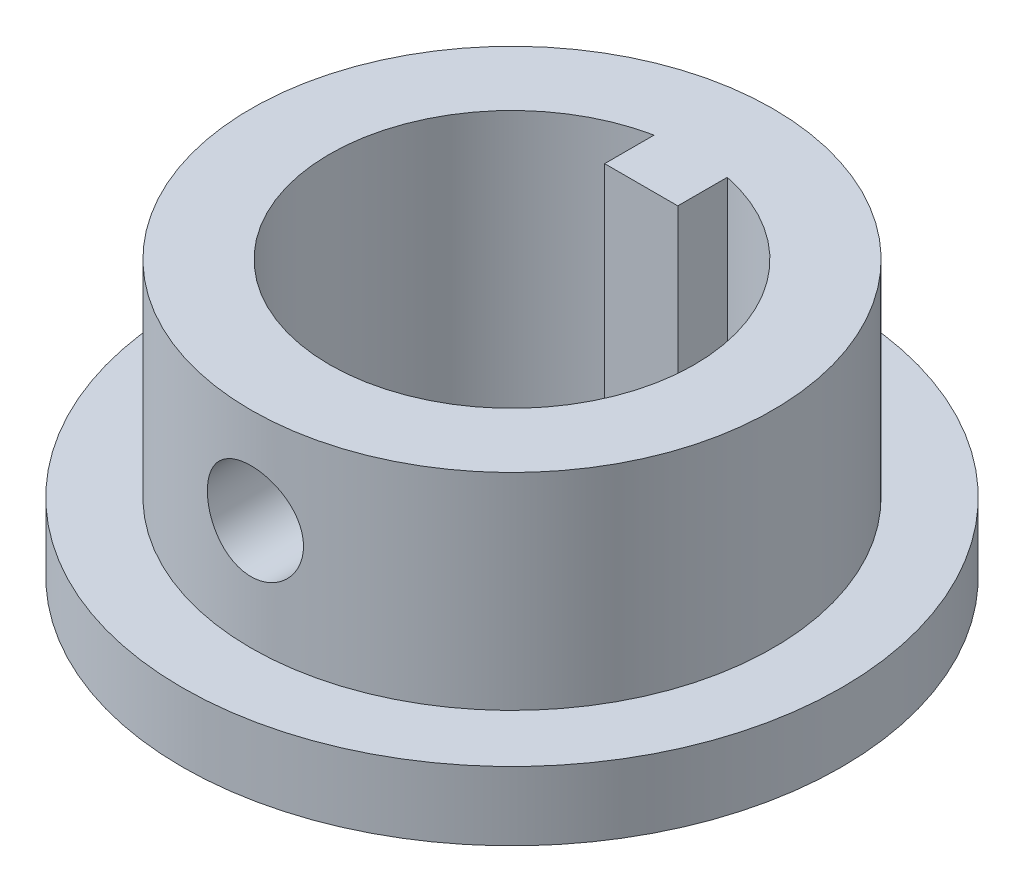
ISO-10303-21;
HEADER;
FILE_DESCRIPTION(('STEP AP214'),'2;1');
FILE_NAME('part.step','',(''),(''),'','','');
FILE_SCHEMA(('AUTOMOTIVE_DESIGN { 1 0 10303 214 1 1 1 1 }'));
ENDSEC;
DATA;
#1=APPLICATION_CONTEXT('core data for automotive mechanical design processes');
#2=APPLICATION_PROTOCOL_DEFINITION('international standard','automotive_design',2000,#1);
#3=PRODUCT_CONTEXT('',#1,'mechanical');
#4=PRODUCT('Part','Part','',(#3));
#5=PRODUCT_RELATED_PRODUCT_CATEGORY('part','',(#4));
#6=PRODUCT_DEFINITION_FORMATION('','',#4);
#7=PRODUCT_DEFINITION_CONTEXT('part definition',#1,'design');
#8=PRODUCT_DEFINITION('design','',#6,#7);
#9=PRODUCT_DEFINITION_SHAPE('','',#8);
#10=(LENGTH_UNIT() NAMED_UNIT(*) SI_UNIT(.MILLI.,.METRE.));
#11=(NAMED_UNIT(*) PLANE_ANGLE_UNIT() SI_UNIT($,.RADIAN.));
#12=(NAMED_UNIT(*) SI_UNIT($,.STERADIAN.) SOLID_ANGLE_UNIT());
#13=UNCERTAINTY_MEASURE_WITH_UNIT(LENGTH_MEASURE(1.E-05),#10,'distance_accuracy_value','');
#14=(GEOMETRIC_REPRESENTATION_CONTEXT(3) GLOBAL_UNCERTAINTY_ASSIGNED_CONTEXT((#13)) GLOBAL_UNIT_ASSIGNED_CONTEXT((#10,
#11,#12)) REPRESENTATION_CONTEXT('',''));
#15=CARTESIAN_POINT('',(0.,0.,0.));
#16=DIRECTION('',(0.,0.,1.));
#17=DIRECTION('',(1.,0.,0.));
#18=AXIS2_PLACEMENT_3D('',#15,#16,#17);
#19=CARTESIAN_POINT('',(0.,10.,0.));
#20=DIRECTION('',(0.,-1.,0.));
#21=DIRECTION('',(0.,0.,-1.));
#22=AXIS2_PLACEMENT_3D('',#19,#20,#21);
#23=CYLINDRICAL_SURFACE('',#22,9.5);
#24=CARTESIAN_POINT('',(0.,2.5,0.));
#25=DIRECTION('',(0.,-1.,0.));
#26=DIRECTION('',(0.,0.,-1.));
#27=AXIS2_PLACEMENT_3D('',#24,#25,#26);
#28=CIRCLE('',#27,9.5);
#29=CARTESIAN_POINT('',(0.,2.5,-9.5));
#30=VERTEX_POINT('',#29);
#31=EDGE_CURVE('E11',#30,#30,#28,.T.);
#32=ORIENTED_EDGE('',*,*,#31,.F.);
#33=EDGE_LOOP('',(#32));
#34=FACE_BOUND('',#33,.T.);
#35=CARTESIAN_POINT('',(0.,10.,0.));
#36=DIRECTION('',(0.,1.,0.));
#37=DIRECTION('',(0.,0.,1.));
#38=AXIS2_PLACEMENT_3D('',#35,#36,#37);
#39=CIRCLE('',#38,9.5);
#40=CARTESIAN_POINT('',(0.,10.,9.5));
#41=VERTEX_POINT('',#40);
#42=EDGE_CURVE('E37',#41,#41,#39,.T.);
#43=ORIENTED_EDGE('',*,*,#42,.F.);
#44=EDGE_LOOP('',(#43));
#45=FACE_BOUND('',#44,.T.);
#46=CARTESIAN_POINT('',(-1.75011073725735,6.49999993917014,9.33740394367388));
#47=CARTESIAN_POINT('',(-1.75010696944772,6.40260077643035,9.33740581185539));
#48=CARTESIAN_POINT('',(-1.74195178818396,6.30515235884925,9.3389445512419));
#49=CARTESIAN_POINT('',(-1.70956723261317,6.11300108865583,9.34492593726401));
#50=CARTESIAN_POINT('',(-1.68532402626827,6.01830067188957,9.34937108269847));
#51=CARTESIAN_POINT('',(-1.62153130404285,5.83445356782631,9.36064516094342));
#52=CARTESIAN_POINT('',(-1.58199580400082,5.74530188156344,9.36747191038327));
#53=CARTESIAN_POINT('',(-1.4887775460969,5.57490301554093,9.38273744938957));
#54=CARTESIAN_POINT('',(-1.43509597221551,5.49365517503389,9.39117610402853));
#55=CARTESIAN_POINT('',(-1.31442167466078,5.34038726304668,9.4088279628298));
#56=CARTESIAN_POINT('',(-1.2472918496987,5.26847596890592,9.41804852845152));
#57=CARTESIAN_POINT('',(-1.1019229373502,5.13686970939778,9.4361602825264));
#58=CARTESIAN_POINT('',(-1.0236831331508,5.07717553288282,9.44505144968016));
#59=CARTESIAN_POINT('',(-0.857602176434648,4.97128248648333,9.46158140223151));
#60=CARTESIAN_POINT('',(-0.769694711791891,4.92518597908638,9.46921050738527));
#61=CARTESIAN_POINT('',(-0.587219320751095,4.84845599856823,9.48227450862614));
#62=CARTESIAN_POINT('',(-0.49265192353728,4.81782129846048,9.48770957881614));
#63=CARTESIAN_POINT('',(-0.300667636456137,4.77322028362535,9.49572123177255));
#64=CARTESIAN_POINT('',(-0.203294652536853,4.75907071070308,9.49832921890255));
#65=CARTESIAN_POINT('',(-0.00752422232243533,4.74727080780485,9.50050115043013));
#66=CARTESIAN_POINT('',(0.0908731389684866,4.74961911953883,9.50006534542667));
#67=CARTESIAN_POINT('',(0.284642846994462,4.77060738579978,9.49622347639607));
#68=CARTESIAN_POINT('',(0.380037384699559,4.78905000327692,9.49285339157741));
#69=CARTESIAN_POINT('',(0.566354246626488,4.84139150223,9.4835620465836));
#70=CARTESIAN_POINT('',(0.657276412010579,4.87529093222113,9.47764069587221));
#71=CARTESIAN_POINT('',(0.832642107447092,4.9577730317356,9.46385193606036));
#72=CARTESIAN_POINT('',(0.917047507951808,5.00643494861982,9.45597406650857));
#73=CARTESIAN_POINT('',(1.07656846242396,5.11700235544197,9.43914422809995));
#74=CARTESIAN_POINT('',(1.15168310223187,5.1789091469691,9.43019215371777));
#75=CARTESIAN_POINT('',(1.29165879584585,5.315297428505,9.41204979701754));
#76=CARTESIAN_POINT('',(1.35635159147535,5.38995150874974,9.40285795019615));
#77=CARTESIAN_POINT('',(1.47232307595875,5.54913919690307,9.38539901079131));
#78=CARTESIAN_POINT('',(1.523601581697,5.63367293965406,9.37713193083254));
#79=CARTESIAN_POINT('',(1.61133443344915,5.81043891723298,9.36245654430822));
#80=CARTESIAN_POINT('',(1.64776500341957,5.9026832166227,9.35605122365058));
#81=CARTESIAN_POINT('',(1.70456404572911,6.0921276313259,9.34587086917729));
#82=CARTESIAN_POINT('',(1.72493426968059,6.18932720496381,9.34209554852744));
#83=CARTESIAN_POINT('',(1.74879019303096,6.38440787116884,9.33765922325132));
#84=CARTESIAN_POINT('',(1.75251729224085,6.4822584611058,9.33695369675139));
#85=CARTESIAN_POINT('',(1.74362764072741,6.67718402352584,9.33861779746372));
#86=CARTESIAN_POINT('',(1.73101166857151,6.77425903273514,9.34098727818575));
#87=CARTESIAN_POINT('',(1.69000100901557,6.96408862790145,9.34849298194348));
#88=CARTESIAN_POINT('',(1.66173226815009,7.05687137512969,9.35360711079952));
#89=CARTESIAN_POINT('',(1.59035189297185,7.23638333218014,9.36600689749988));
#90=CARTESIAN_POINT('',(1.54723919809037,7.32311210892646,9.37329271050138));
#91=CARTESIAN_POINT('',(1.44683677377809,7.48911953311655,9.38931662770659));
#92=CARTESIAN_POINT('',(1.3893941786049,7.56830422155581,9.39807003397046));
#93=CARTESIAN_POINT('',(1.26216926986717,7.71599789652576,9.41599946949427));
#94=CARTESIAN_POINT('',(1.19238588725006,7.78450595719797,9.42517553531721));
#95=CARTESIAN_POINT('',(1.04138355904204,7.90980015851483,9.44305900625888));
#96=CARTESIAN_POINT('',(0.960029055161715,7.9664241727044,9.45175886411124));
#97=CARTESIAN_POINT('',(0.788821597904413,8.06520013696244,9.46758365609598));
#98=CARTESIAN_POINT('',(0.698968963861776,8.10735263055206,9.47470864937353));
#99=CARTESIAN_POINT('',(0.51376950573746,8.17574463294351,9.48654831605835));
#100=CARTESIAN_POINT('',(0.418453223817946,8.20206464751473,9.49127516410277));
#101=CARTESIAN_POINT('',(0.224658003209876,8.23830193156678,9.4978377154358));
#102=CARTESIAN_POINT('',(0.12617938622889,8.24822086419126,9.4996737118689));
#103=CARTESIAN_POINT('',(-0.0695884965988357,8.2513181897731,9.50024206469378));
#104=CARTESIAN_POINT('',(-0.166873836621156,8.24474176409268,9.49901987753167));
#105=CARTESIAN_POINT('',(-0.358928308867747,8.21557095535078,9.49370325803109));
#106=CARTESIAN_POINT('',(-0.453697463395051,8.19297671431765,9.4896088511603));
#107=CARTESIAN_POINT('',(-0.637905925521135,8.13251343434026,9.47900738827038));
#108=CARTESIAN_POINT('',(-0.727353751543044,8.09466960582518,9.47250431565491));
#109=CARTESIAN_POINT('',(-0.898666854132146,8.00481042011117,9.45779037286336));
#110=CARTESIAN_POINT('',(-0.980531645995184,7.95279415785305,9.44957939362736));
#111=CARTESIAN_POINT('',(-1.13557907488448,7.83521836172628,9.43221280982626));
#112=CARTESIAN_POINT('',(-1.20862577786571,7.76948125056611,9.42304569838461));
#113=CARTESIAN_POINT('',(-1.34273646557264,7.62669908370989,9.4048737487714));
#114=CARTESIAN_POINT('',(-1.40379763139424,7.54965137528009,9.39586894922549));
#115=CARTESIAN_POINT('',(-1.5127117251442,7.38561741953293,9.37895391476232));
#116=CARTESIAN_POINT('',(-1.56044255646522,7.29854899803032,9.3710541089899));
#117=CARTESIAN_POINT('',(-1.64052383267915,7.1175130326686,9.35736852139163));
#118=CARTESIAN_POINT('',(-1.67288893718727,7.02355216375538,9.35158072583527));
#119=CARTESIAN_POINT('',(-1.71466693707275,6.85774874525798,9.34399410975865));
#120=CARTESIAN_POINT('',(-1.72793582791851,6.78688280540296,9.34153731543979));
#121=CARTESIAN_POINT('',(-1.74565900843639,6.64402018185439,9.33824156234502));
#122=CARTESIAN_POINT('',(-1.75011352343293,6.57202352711307,9.33740256221297));
#123=CARTESIAN_POINT('',(-1.75011073725735,6.49999993917014,9.33740394367388));
#124=B_SPLINE_CURVE_WITH_KNOTS('',3,(#46,#47,#48,#49,#50,#51,#52,#53,#54,#55,#56,#57,#58,#59,
#60,#61,#62,#63,#64,#65,#66,#67,#68,#69,#70,#71,#72,#73,#74,#75,#76,#77,#78,#79,#80,#81,#82,#83,
#84,#85,#86,#87,#88,#89,#90,#91,#92,#93,#94,#95,#96,#97,#98,#99,#100,#101,#102,#103,#104,#105,
#106,#107,#108,#109,#110,#111,#112,#113,#114,#115,#116,#117,#118,#119,#120,#121,#122,#123),
.UNSPECIFIED.,.T.,.F.,(4,2,2,2,2,2,2,2,2,2,2,2,2,2,2,2,2,2,2,2,2,2,2,2,2,2,2,2,2,2,2,2,2,2,2,2,
2,2,4),(0.,0.291933949691373,0.584119221853463,0.876037329726165,1.16793101275609,
1.46296759556463,1.75802322271351,2.05524642386862,2.35244603488175,2.64630929087725,
2.94014835305203,3.23043440057825,3.52073075027399,3.81261389211017,4.10452573082716,
4.40075908115783,4.69699647509632,4.9937063885287,5.29038393698743,5.58274405488646,
5.87509024555675,6.16511761922692,6.45516571903308,6.74845118436697,7.04176206876818,
7.33884607808807,7.63591892831049,7.93146815020389,8.22698740023552,8.51814025995612,
8.80929053808604,9.09996145203486,9.390650932736,9.68536600324287,9.98015030558212,
10.2775521381128,10.5746696624917,10.7905510666573,11.0064269521133),.UNSPECIFIED.);
#125=CARTESIAN_POINT('',(-1.75011073725735,6.49999993917014,9.33740394367388));
#126=VERTEX_POINT('',#125);
#127=EDGE_CURVE('E95',#126,#126,#124,.T.);
#128=ORIENTED_EDGE('',*,*,#127,.F.);
#129=EDGE_LOOP('',(#128));
#130=FACE_BOUND('',#129,.T.);
#131=ADVANCED_FACE('F33',(#34,#45,#130),#23,.T.);
#132=CARTESIAN_POINT('',(0.,10.,0.));
#133=DIRECTION('',(0.,-1.,0.));
#134=DIRECTION('',(0.,0.,-1.));
#135=AXIS2_PLACEMENT_3D('',#132,#133,#134);
#136=CYLINDRICAL_SURFACE('',#135,6.639);
#137=DIRECTION('',(0.,-1.,0.));
#138=VECTOR('',#137,1.);
#139=CARTESIAN_POINT('',(1.33,10.,-6.50441550025827));
#140=LINE('',#139,#138);
#141=CARTESIAN_POINT('',(1.33,10.,-6.50441550025827));
#142=VERTEX_POINT('',#141);
#143=CARTESIAN_POINT('',(1.33,0.,-6.50441550025827));
#144=VERTEX_POINT('',#143);
#145=EDGE_CURVE('E49',#142,#144,#140,.T.);
#146=ORIENTED_EDGE('',*,*,#145,.T.);
#147=CARTESIAN_POINT('',(0.,0.,0.));
#148=DIRECTION('',(0.,1.,0.));
#149=DIRECTION('',(0.,0.,1.));
#150=AXIS2_PLACEMENT_3D('',#147,#148,#149);
#151=CIRCLE('',#150,6.639);
#152=CARTESIAN_POINT('',(-1.332,0.,-6.50400622693429));
#153=VERTEX_POINT('',#152);
#154=EDGE_CURVE('E84',#153,#144,#151,.T.);
#155=ORIENTED_EDGE('',*,*,#154,.F.);
#156=DIRECTION('',(0.,-1.,0.));
#157=VECTOR('',#156,1.);
#158=CARTESIAN_POINT('',(-1.332,10.,-6.50400622693429));
#159=LINE('',#158,#157);
#160=CARTESIAN_POINT('',(-1.332,10.,-6.50400622693429));
#161=VERTEX_POINT('',#160);
#162=EDGE_CURVE('E74',#161,#153,#159,.T.);
#163=ORIENTED_EDGE('',*,*,#162,.F.);
#164=CARTESIAN_POINT('',(0.,10.,0.));
#165=DIRECTION('',(0.,1.,0.));
#166=DIRECTION('',(0.,0.,1.));
#167=AXIS2_PLACEMENT_3D('',#164,#165,#166);
#168=CIRCLE('',#167,6.639);
#169=EDGE_CURVE('E111',#161,#142,#168,.T.);
#170=ORIENTED_EDGE('',*,*,#169,.T.);
#171=EDGE_LOOP('',(#146,#155,#163,#170));
#172=FACE_BOUND('',#171,.T.);
#173=CARTESIAN_POINT('',(-1.75011073725735,6.49999993917014,6.40417312440385));
#174=CARTESIAN_POINT('',(-1.75010832865585,6.40355240710837,6.404174834426));
#175=CARTESIAN_POINT('',(-1.74211032252823,6.30707917134735,6.40637584124456));
#176=CARTESIAN_POINT('',(-1.71038843753164,6.11691588695023,6.41491646111013));
#177=CARTESIAN_POINT('',(-1.68665643258753,6.02322730262967,6.42125821268527));
#178=CARTESIAN_POINT('',(-1.62429844636526,5.84141169003368,6.43731331814524));
#179=CARTESIAN_POINT('',(-1.58569308355798,5.75327715828778,6.44702200270387));
#180=CARTESIAN_POINT('',(-1.4947485171516,5.58472272765413,6.46871117605166));
#181=CARTESIAN_POINT('',(-1.44240833655789,5.50430337812402,6.48069182643506));
#182=CARTESIAN_POINT('',(-1.32411196430109,5.35149613119881,6.5059032144099));
#183=CARTESIAN_POINT('',(-1.25788067496077,5.27932474754113,6.51915571134517));
#184=CARTESIAN_POINT('',(-1.11427396844885,5.14697486803625,6.54522970656402));
#185=CARTESIAN_POINT('',(-1.03689741906243,5.08679759211816,6.5580511608958));
#186=CARTESIAN_POINT('',(-0.871698516855871,4.97924435222512,6.58206097261413));
#187=CARTESIAN_POINT('',(-0.783731791709409,4.93208318717536,6.59322067061182));
#188=CARTESIAN_POINT('',(-0.600774858595007,4.85330092041903,6.61240030463295));
#189=CARTESIAN_POINT('',(-0.505785809704872,4.82167726071065,6.62042075743868));
#190=CARTESIAN_POINT('',(-0.313739729360822,4.77556698997194,6.63226450904145));
#191=CARTESIAN_POINT('',(-0.216776736767485,4.76071224145347,6.63617783272456));
#192=CARTESIAN_POINT('',(-0.0216612477524705,4.74740377635529,6.63968113495315));
#193=CARTESIAN_POINT('',(0.0764910513153929,4.74894737487291,6.63927182124446));
#194=CARTESIAN_POINT('',(0.268637902520263,4.76813149871113,6.63424223324703));
#195=CARTESIAN_POINT('',(0.362675303281849,4.78537428992998,6.62972600965805));
#196=CARTESIAN_POINT('',(0.546471629448017,4.83482543157829,6.61711270213866));
#197=CARTESIAN_POINT('',(0.636230313521858,4.86703462505313,6.60901541649115));
#198=CARTESIAN_POINT('',(0.809942251916643,4.94581210799199,6.58999476535925));
#199=CARTESIAN_POINT('',(0.893830230696005,4.99251759095889,6.57904456594901));
#200=CARTESIAN_POINT('',(1.05271426077727,5.0988567915318,6.5554995276931));
#201=CARTESIAN_POINT('',(1.12770860933773,5.15849297864072,6.54290437487758));
#202=CARTESIAN_POINT('',(1.26904980358056,5.29111564753812,6.51698988443349));
#203=CARTESIAN_POINT('',(1.33506955642774,5.36444909404485,6.50366015731462));
#204=CARTESIAN_POINT('',(1.4539524870941,5.52128481306126,6.47812092403723));
#205=CARTESIAN_POINT('',(1.50681490007555,5.60478767630034,6.46591148302709));
#206=CARTESIAN_POINT('',(1.59812415965783,5.78028856256165,6.443954420048));
#207=CARTESIAN_POINT('',(1.63648399777617,5.87233385845921,6.43422176800839));
#208=CARTESIAN_POINT('',(1.69707851341943,6.06188727207225,6.41850731998614));
#209=CARTESIAN_POINT('',(1.71931708417503,6.15939406472344,6.41252461845061));
#210=CARTESIAN_POINT('',(1.74647797460357,6.35404870837116,6.40517988315712));
#211=CARTESIAN_POINT('',(1.75188736000528,6.45112377140303,6.40368792227432));
#212=CARTESIAN_POINT('',(1.74657668012532,6.64479101720534,6.40513846460087));
#213=CARTESIAN_POINT('',(1.73585828673353,6.74138324898716,6.40808050815819));
#214=CARTESIAN_POINT('',(1.69902528262173,6.92947910442366,6.41794223112521));
#215=CARTESIAN_POINT('',(1.67320173250212,7.02104405181129,6.424786654364));
#216=CARTESIAN_POINT('',(1.60721785085964,7.19854356431105,6.44160877584883));
#217=CARTESIAN_POINT('',(1.56705567920339,7.28447740508441,6.45158687623255));
#218=CARTESIAN_POINT('',(1.47253997330402,7.45031813675535,6.47382000171819));
#219=CARTESIAN_POINT('',(1.41789942599918,7.53005536344541,6.48611943706781));
#220=CARTESIAN_POINT('',(1.29633511222458,7.67940792397706,6.51150399455483));
#221=CARTESIAN_POINT('',(1.22940909191142,7.74902139634876,6.5245892605607));
#222=CARTESIAN_POINT('',(1.08292400203993,7.87816301488338,6.55051698460797));
#223=CARTESIAN_POINT('',(1.00306229127568,7.93735200964401,6.56334223251751));
#224=CARTESIAN_POINT('',(0.834253236823253,8.0414828363088,6.58692604053595));
#225=CARTESIAN_POINT('',(0.745306376563541,8.08642542575456,6.59768471052154));
#226=CARTESIAN_POINT('',(0.561477383979413,8.1603787146325,6.61585383231535));
#227=CARTESIAN_POINT('',(0.46664543020536,8.18950776014213,6.62328907983787));
#228=CARTESIAN_POINT('',(0.273207944740784,8.23135300681534,6.63408249184135));
#229=CARTESIAN_POINT('',(0.174603233431733,8.24407275550961,6.63744153754825));
#230=CARTESIAN_POINT('',(-0.0204086972022326,8.25252037552704,6.63966343926759));
#231=CARTESIAN_POINT('',(-0.116793147711144,8.24874633421618,6.63865809929786));
#232=CARTESIAN_POINT('',(-0.307504031048176,8.22546709500386,6.63256098202087));
#233=CARTESIAN_POINT('',(-0.401830537842528,8.20596246344817,6.62746935183165));
#234=CARTESIAN_POINT('',(-0.58516378814804,8.15205464261077,6.6137966924563));
#235=CARTESIAN_POINT('',(-0.674201470603519,8.11775040055899,6.60523886044765));
#236=CARTESIAN_POINT('',(-0.84530811231497,8.03530571650795,6.58552967787918));
#237=CARTESIAN_POINT('',(-0.927376109715612,7.98716336877978,6.57437797014149));
#238=CARTESIAN_POINT('',(-1.08454125937006,7.87693947097865,6.55031162871612));
#239=CARTESIAN_POINT('',(-1.15939982527753,7.81452615030153,6.53735850158063));
#240=CARTESIAN_POINT('',(-1.29774961663441,7.67816403455701,6.51130812094778));
#241=CARTESIAN_POINT('',(-1.36123786757904,7.60421223043159,6.49821083068536));
#242=CARTESIAN_POINT('',(-1.4763846430183,7.44497276353975,6.47303368966422));
#243=CARTESIAN_POINT('',(-1.52776169449417,7.35947680653143,6.46098152791556));
#244=CARTESIAN_POINT('',(-1.61533898992609,7.18075366745436,6.43964644576659));
#245=CARTESIAN_POINT('',(-1.65154937562833,7.08753170178917,6.43036167605024));
#246=CARTESIAN_POINT('',(-1.70290108937093,6.91218178707003,6.41693266378796));
#247=CARTESIAN_POINT('',(-1.72056371506445,6.83082957296944,6.41218602677785));
#248=CARTESIAN_POINT('',(-1.74416894384967,6.66632446004027,6.40580568807753));
#249=CARTESIAN_POINT('',(-1.75011281432206,6.58317175691764,6.40417164976113));
#250=CARTESIAN_POINT('',(-1.75011073725735,6.49999993917014,6.40417312440385));
#251=B_SPLINE_CURVE_WITH_KNOTS('',3,(#173,#174,#175,#176,#177,#178,#179,#180,#181,#182,#183,
#184,#185,#186,#187,#188,#189,#190,#191,#192,#193,#194,#195,#196,#197,#198,#199,#200,#201,#202,
#203,#204,#205,#206,#207,#208,#209,#210,#211,#212,#213,#214,#215,#216,#217,#218,#219,#220,#221,
#222,#223,#224,#225,#226,#227,#228,#229,#230,#231,#232,#233,#234,#235,#236,#237,#238,#239,#240,
#241,#242,#243,#244,#245,#246,#247,#248,#249,#250),.UNSPECIFIED.,.T.,.F.,(4,2,2,2,2,2,2,2,2,2,2,
2,2,2,2,2,2,2,2,2,2,2,2,2,2,2,2,2,2,2,2,2,2,2,2,2,2,2,4),(0.,0.289036837188502,0.57822306847914,
0.867009844103812,1.15581716748094,1.45100067629983,1.7462141931366,2.04604216460874,
2.34582075764549,2.63888173414402,2.93189472848514,3.21768482694654,3.50349102568579,
3.79208912624632,4.08074239182868,4.37805904978519,4.67539298676027,4.97448349715858,
5.27350175414248,5.56378134691752,5.8540308498651,6.13886365236679,6.42373302176288,
6.71473768226187,7.00579578275489,7.30504895996869,7.6042862219558,7.90125203589816,
8.19815363794928,8.48615223837627,8.77414047050135,9.06023240533218,9.34636375849956,
9.63998198842429,9.93367691781945,10.233641607521,10.533405393384,10.7826841353589,
11.031935916416),.UNSPECIFIED.);
#252=CARTESIAN_POINT('',(-1.75011073725735,6.49999993917014,6.40417312440385));
#253=VERTEX_POINT('',#252);
#254=EDGE_CURVE('E98',#253,#253,#251,.T.);
#255=ORIENTED_EDGE('',*,*,#254,.T.);
#256=EDGE_LOOP('',(#255));
#257=FACE_BOUND('',#256,.T.);
#258=ADVANCED_FACE('F85',(#172,#257),#136,.F.);
#259=CARTESIAN_POINT('',(1.33,10.,-4.70400622693429));
#260=DIRECTION('',(1.,0.,0.));
#261=DIRECTION('',(0.,0.,-1.));
#262=AXIS2_PLACEMENT_3D('',#259,#260,#261);
#263=PLANE('',#262);
#264=DIRECTION('',(0.,-1.,0.));
#265=VECTOR('',#264,1.);
#266=CARTESIAN_POINT('',(1.33,10.,-4.70400622693429));
#267=LINE('',#266,#265);
#268=CARTESIAN_POINT('',(1.33,10.,-4.70400622693429));
#269=VERTEX_POINT('',#268);
#270=CARTESIAN_POINT('',(1.33,0.,-4.70400622693429));
#271=VERTEX_POINT('',#270);
#272=EDGE_CURVE('E121',#269,#271,#267,.T.);
#273=ORIENTED_EDGE('',*,*,#272,.T.);
#274=DIRECTION('',(0.,0.,1.));
#275=VECTOR('',#274,1.);
#276=CARTESIAN_POINT('',(1.33,0.,-4.70400622693429));
#277=LINE('',#276,#275);
#278=EDGE_CURVE('E89',#144,#271,#277,.T.);
#279=ORIENTED_EDGE('',*,*,#278,.F.);
#280=ORIENTED_EDGE('',*,*,#145,.F.);
#281=DIRECTION('',(0.,0.,1.));
#282=VECTOR('',#281,1.);
#283=CARTESIAN_POINT('',(1.33,10.,-4.70400622693429));
#284=LINE('',#283,#282);
#285=EDGE_CURVE('E115',#142,#269,#284,.T.);
#286=ORIENTED_EDGE('',*,*,#285,.T.);
#287=EDGE_LOOP('',(#273,#279,#280,#286));
#288=FACE_BOUND('',#287,.T.);
#289=ADVANCED_FACE('F154',(#288),#263,.T.);
#290=CARTESIAN_POINT('',(-1.332,10.,-4.70400622693429));
#291=DIRECTION('',(0.,0.,1.));
#292=DIRECTION('',(1.,0.,0.));
#293=AXIS2_PLACEMENT_3D('',#290,#291,#292);
#294=PLANE('',#293);
#295=DIRECTION('',(0.,-1.,0.));
#296=VECTOR('',#295,1.);
#297=CARTESIAN_POINT('',(-1.332,10.,-4.70400622693429));
#298=LINE('',#297,#296);
#299=CARTESIAN_POINT('',(-1.332,10.,-4.70400622693429));
#300=VERTEX_POINT('',#299);
#301=CARTESIAN_POINT('',(-1.332,0.,-4.70400622693429));
#302=VERTEX_POINT('',#301);
#303=EDGE_CURVE('E57',#300,#302,#298,.T.);
#304=ORIENTED_EDGE('',*,*,#303,.T.);
#305=DIRECTION('',(-1.,0.,0.));
#306=VECTOR('',#305,1.);
#307=CARTESIAN_POINT('',(-1.332,0.,-4.70400622693429));
#308=LINE('',#307,#306);
#309=EDGE_CURVE('E94',#271,#302,#308,.T.);
#310=ORIENTED_EDGE('',*,*,#309,.F.);
#311=ORIENTED_EDGE('',*,*,#272,.F.);
#312=DIRECTION('',(-1.,0.,0.));
#313=VECTOR('',#312,1.);
#314=CARTESIAN_POINT('',(-1.332,10.,-4.70400622693429));
#315=LINE('',#314,#313);
#316=EDGE_CURVE('E117',#269,#300,#315,.T.);
#317=ORIENTED_EDGE('',*,*,#316,.T.);
#318=EDGE_LOOP('',(#304,#310,#311,#317));
#319=FACE_BOUND('',#318,.T.);
#320=ADVANCED_FACE('F162',(#319),#294,.T.);
#321=CARTESIAN_POINT('',(-1.332,10.,-6.50400622693429));
#322=DIRECTION('',(-1.,0.,0.));
#323=DIRECTION('',(0.,0.,1.));
#324=AXIS2_PLACEMENT_3D('',#321,#322,#323);
#325=PLANE('',#324);
#326=ORIENTED_EDGE('',*,*,#162,.T.);
#327=DIRECTION('',(0.,0.,-1.));
#328=VECTOR('',#327,1.);
#329=CARTESIAN_POINT('',(-1.332,0.,-6.50400622693429));
#330=LINE('',#329,#328);
#331=EDGE_CURVE('E77',#302,#153,#330,.T.);
#332=ORIENTED_EDGE('',*,*,#331,.F.);
#333=ORIENTED_EDGE('',*,*,#303,.F.);
#334=DIRECTION('',(0.,0.,-1.));
#335=VECTOR('',#334,1.);
#336=CARTESIAN_POINT('',(-1.332,10.,-6.50400622693429));
#337=LINE('',#336,#335);
#338=EDGE_CURVE('E80',#300,#161,#337,.T.);
#339=ORIENTED_EDGE('',*,*,#338,.T.);
#340=EDGE_LOOP('',(#326,#332,#333,#339));
#341=FACE_BOUND('',#340,.T.);
#342=ADVANCED_FACE('F75',(#341),#325,.T.);
#343=CARTESIAN_POINT('',(0.,10.,0.));
#344=DIRECTION('',(0.,1.,0.));
#345=DIRECTION('',(0.,0.,1.));
#346=AXIS2_PLACEMENT_3D('',#343,#344,#345);
#347=PLANE('',#346);
#348=ORIENTED_EDGE('',*,*,#42,.T.);
#349=EDGE_LOOP('',(#348));
#350=FACE_BOUND('',#349,.T.);
#351=ORIENTED_EDGE('',*,*,#285,.F.);
#352=ORIENTED_EDGE('',*,*,#169,.F.);
#353=ORIENTED_EDGE('',*,*,#338,.F.);
#354=ORIENTED_EDGE('',*,*,#316,.F.);
#355=EDGE_LOOP('',(#351,#352,#353,#354));
#356=FACE_BOUND('',#355,.T.);
#357=ADVANCED_FACE('F125',(#350,#356),#347,.T.);
#358=CARTESIAN_POINT('',(0.,2.5,0.));
#359=DIRECTION('',(0.,-1.,0.));
#360=DIRECTION('',(0.,0.,-1.));
#361=AXIS2_PLACEMENT_3D('',#358,#359,#360);
#362=PLANE('',#361);
#363=CARTESIAN_POINT('',(0.,2.5,0.));
#364=DIRECTION('',(0.,-1.,0.));
#365=DIRECTION('',(0.,0.,-1.));
#366=AXIS2_PLACEMENT_3D('',#363,#364,#365);
#367=CIRCLE('',#366,12.);
#368=CARTESIAN_POINT('',(0.,2.5,-12.));
#369=VERTEX_POINT('',#368);
#370=EDGE_CURVE('E108',#369,#369,#367,.T.);
#371=ORIENTED_EDGE('',*,*,#370,.F.);
#372=EDGE_LOOP('',(#371));
#373=FACE_BOUND('',#372,.T.);
#374=ORIENTED_EDGE('',*,*,#31,.T.);
#375=EDGE_LOOP('',(#374));
#376=FACE_BOUND('',#375,.T.);
#377=ADVANCED_FACE('F143',(#373,#376),#362,.F.);
#378=CARTESIAN_POINT('',(0.,2.5,0.));
#379=DIRECTION('',(0.,-1.,0.));
#380=DIRECTION('',(0.,0.,-1.));
#381=AXIS2_PLACEMENT_3D('',#378,#379,#380);
#382=CYLINDRICAL_SURFACE('',#381,12.);
#383=ORIENTED_EDGE('',*,*,#370,.T.);
#384=EDGE_LOOP('',(#383));
#385=FACE_BOUND('',#384,.T.);
#386=CARTESIAN_POINT('',(0.,0.,0.));
#387=DIRECTION('',(0.,-1.,0.));
#388=DIRECTION('',(0.,0.,-1.));
#389=AXIS2_PLACEMENT_3D('',#386,#387,#388);
#390=CIRCLE('',#389,12.);
#391=CARTESIAN_POINT('',(0.,0.,-12.));
#392=VERTEX_POINT('',#391);
#393=EDGE_CURVE('E107',#392,#392,#390,.T.);
#394=ORIENTED_EDGE('',*,*,#393,.F.);
#395=EDGE_LOOP('',(#394));
#396=FACE_BOUND('',#395,.T.);
#397=ADVANCED_FACE('F139',(#385,#396),#382,.T.);
#398=CARTESIAN_POINT('',(0.,0.,0.));
#399=DIRECTION('',(0.,1.,0.));
#400=DIRECTION('',(0.,0.,1.));
#401=AXIS2_PLACEMENT_3D('',#398,#399,#400);
#402=PLANE('',#401);
#403=ORIENTED_EDGE('',*,*,#309,.T.);
#404=ORIENTED_EDGE('',*,*,#331,.T.);
#405=ORIENTED_EDGE('',*,*,#154,.T.);
#406=ORIENTED_EDGE('',*,*,#278,.T.);
#407=EDGE_LOOP('',(#403,#404,#405,#406));
#408=FACE_BOUND('',#407,.T.);
#409=ORIENTED_EDGE('',*,*,#393,.T.);
#410=EDGE_LOOP('',(#409));
#411=FACE_BOUND('',#410,.T.);
#412=ADVANCED_FACE('F91',(#408,#411),#402,.F.);
#413=CARTESIAN_POINT('',(-0.000110737257354362,6.49999993917014,10.2959937730657));
#414=DIRECTION('',(0.,0.,-1.));
#415=DIRECTION('',(-1.,0.,0.));
#416=AXIS2_PLACEMENT_3D('',#413,#414,#415);
#417=CYLINDRICAL_SURFACE('',#416,1.75);
#418=ORIENTED_EDGE('',*,*,#254,.F.);
#419=EDGE_LOOP('',(#418));
#420=FACE_BOUND('',#419,.T.);
#421=ORIENTED_EDGE('',*,*,#127,.T.);
#422=EDGE_LOOP('',(#421));
#423=FACE_BOUND('',#422,.T.);
#424=ADVANCED_FACE('F133',(#420,#423),#417,.F.);
#425=CLOSED_SHELL('',(#131,#258,#289,#320,#342,#357,#377,#397,#412,#424));
#426=MANIFOLD_SOLID_BREP('B2',#425);
#427=ADVANCED_BREP_SHAPE_REPRESENTATION('',(#18,#426),#14);
#428=SHAPE_DEFINITION_REPRESENTATION(#9,#427);
ENDSEC;
END-ISO-10303-21;
